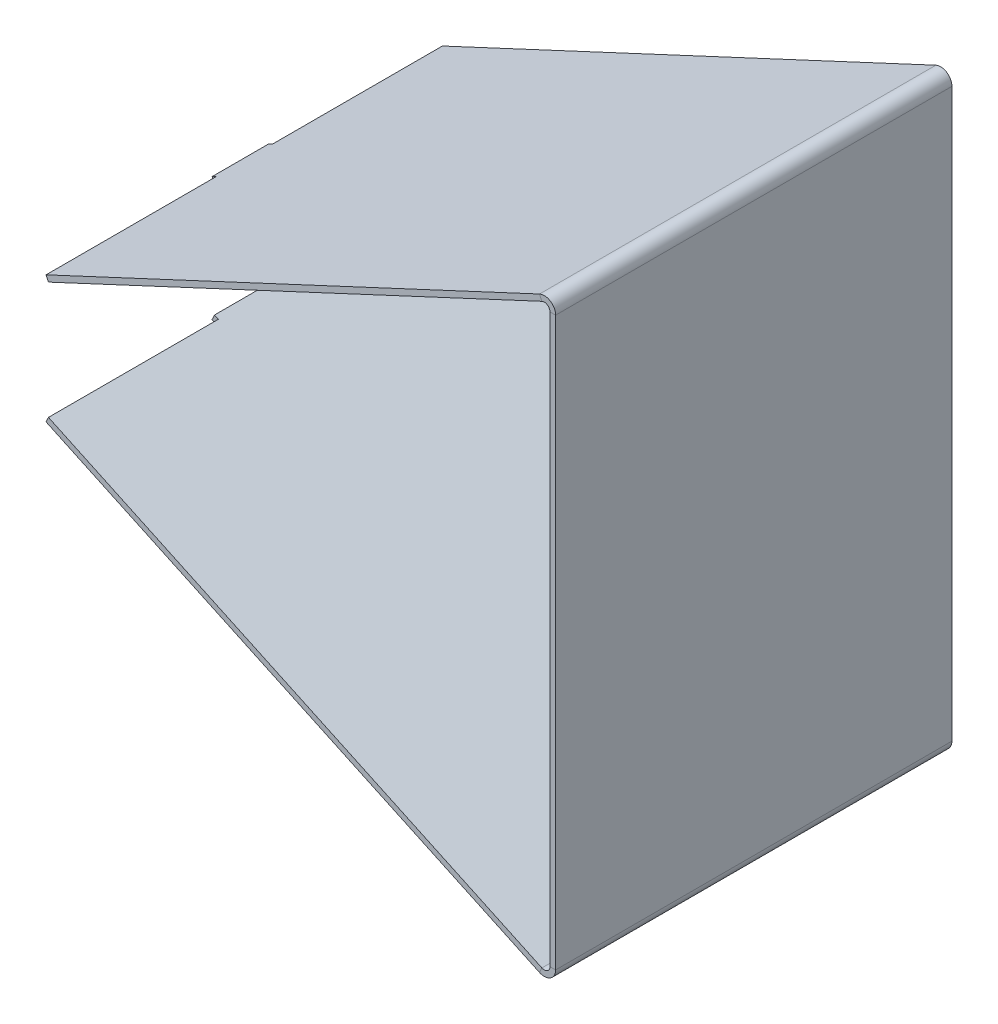
ISO-10303-21;
HEADER;
FILE_DESCRIPTION(('STEP AP214'),'2;1');
FILE_NAME('part.step','',(''),(''),'','','');
FILE_SCHEMA(('AUTOMOTIVE_DESIGN { 1 0 10303 214 1 1 1 1 }'));
ENDSEC;
DATA;
#1=APPLICATION_CONTEXT('core data for automotive mechanical design processes');
#2=APPLICATION_PROTOCOL_DEFINITION('international standard','automotive_design',2000,#1);
#3=PRODUCT_CONTEXT('',#1,'mechanical');
#4=PRODUCT('Part','Part','',(#3));
#5=PRODUCT_RELATED_PRODUCT_CATEGORY('part','',(#4));
#6=PRODUCT_DEFINITION_FORMATION('','',#4);
#7=PRODUCT_DEFINITION_CONTEXT('part definition',#1,'design');
#8=PRODUCT_DEFINITION('design','',#6,#7);
#9=PRODUCT_DEFINITION_SHAPE('','',#8);
#10=(LENGTH_UNIT() NAMED_UNIT(*) SI_UNIT(.MILLI.,.METRE.));
#11=(NAMED_UNIT(*) PLANE_ANGLE_UNIT() SI_UNIT($,.RADIAN.));
#12=(NAMED_UNIT(*) SI_UNIT($,.STERADIAN.) SOLID_ANGLE_UNIT());
#13=UNCERTAINTY_MEASURE_WITH_UNIT(LENGTH_MEASURE(1.E-05),#10,'distance_accuracy_value','');
#14=(GEOMETRIC_REPRESENTATION_CONTEXT(3) GLOBAL_UNCERTAINTY_ASSIGNED_CONTEXT((#13)) GLOBAL_UNIT_ASSIGNED_CONTEXT((#10,
#11,#12)) REPRESENTATION_CONTEXT('',''));
#15=CARTESIAN_POINT('',(0.,0.,0.));
#16=DIRECTION('',(0.,0.,1.));
#17=DIRECTION('',(1.,0.,0.));
#18=AXIS2_PLACEMENT_3D('',#15,#16,#17);
#19=CARTESIAN_POINT('',(640.980552295585,20.6873844259267,142.));
#20=DIRECTION('',(-0.90630778703664,-0.422618261740721,0.));
#21=DIRECTION('',(0.422618261740721,-0.90630778703664,0.));
#22=AXIS2_PLACEMENT_3D('',#19,#20,#21);
#23=PLANE('',#22);
#24=DIRECTION('',(0.,0.,-1.));
#25=VECTOR('',#24,1.);
#26=CARTESIAN_POINT('',(640.980552295585,20.6873844259267,142.));
#27=LINE('',#26,#25);
#28=CARTESIAN_POINT('',(640.980552295585,20.6873844259264,62.));
#29=VERTEX_POINT('',#28);
#30=CARTESIAN_POINT('',(640.980552295585,20.6873844259267,2.));
#31=VERTEX_POINT('',#30);
#32=EDGE_CURVE('E177',#29,#31,#27,.T.);
#33=ORIENTED_EDGE('',*,*,#32,.F.);
#34=DIRECTION('',(-0.422618261740699,0.90630778703665,0.));
#35=VECTOR('',#34,1.);
#36=CARTESIAN_POINT('',(640.980552295585,20.6873844259264,62.));
#37=LINE('',#36,#35);
#38=CARTESIAN_POINT('',(640.135315772103,22.5,62.));
#39=VERTEX_POINT('',#38);
#40=EDGE_CURVE('E184',#29,#39,#37,.T.);
#41=ORIENTED_EDGE('',*,*,#40,.T.);
#42=DIRECTION('',(0.,0.,-1.));
#43=VECTOR('',#42,1.);
#44=CARTESIAN_POINT('',(640.135315772103,22.5,142.));
#45=LINE('',#44,#43);
#46=CARTESIAN_POINT('',(640.135315772103,22.5,2.));
#47=VERTEX_POINT('',#46);
#48=EDGE_CURVE('E198',#39,#47,#45,.T.);
#49=ORIENTED_EDGE('',*,*,#48,.T.);
#50=DIRECTION('',(-0.422618261740721,0.90630778703664,0.));
#51=VECTOR('',#50,1.);
#52=CARTESIAN_POINT('',(640.980552295585,20.6873844259267,2.));
#53=LINE('',#52,#51);
#54=EDGE_CURVE('E193',#31,#47,#53,.T.);
#55=ORIENTED_EDGE('',*,*,#54,.F.);
#56=EDGE_LOOP('',(#33,#41,#49,#55));
#57=FACE_BOUND('',#56,.T.);
#58=ADVANCED_FACE('F36',(#57),#23,.T.);
#59=CARTESIAN_POINT('',(640.135315772103,-22.5,142.));
#60=DIRECTION('',(-0.906307787036642,0.422618261740716,0.));
#61=DIRECTION('',(-0.422618261740716,-0.906307787036642,0.));
#62=AXIS2_PLACEMENT_3D('',#59,#60,#61);
#63=PLANE('',#62);
#64=DIRECTION('',(0.,0.,-1.));
#65=VECTOR('',#64,1.);
#66=CARTESIAN_POINT('',(640.980552295585,-20.6873844259267,142.));
#67=LINE('',#66,#65);
#68=CARTESIAN_POINT('',(640.980552295585,-20.6873844259267,142.));
#69=VERTEX_POINT('',#68);
#70=CARTESIAN_POINT('',(640.980552295585,-20.6873844259264,82.));
#71=VERTEX_POINT('',#70);
#72=EDGE_CURVE('E224',#69,#71,#67,.T.);
#73=ORIENTED_EDGE('',*,*,#72,.T.);
#74=DIRECTION('',(-0.422618261740699,-0.90630778703665,0.));
#75=VECTOR('',#74,1.);
#76=CARTESIAN_POINT('',(640.980552295585,-20.6873844259264,82.));
#77=LINE('',#76,#75);
#78=CARTESIAN_POINT('',(640.135315772103,-22.5,82.));
#79=VERTEX_POINT('',#78);
#80=EDGE_CURVE('E374',#71,#79,#77,.T.);
#81=ORIENTED_EDGE('',*,*,#80,.T.);
#82=DIRECTION('',(0.,0.,-1.));
#83=VECTOR('',#82,1.);
#84=CARTESIAN_POINT('',(640.135315772103,-22.5,142.));
#85=LINE('',#84,#83);
#86=CARTESIAN_POINT('',(640.135315772103,-22.5,142.));
#87=VERTEX_POINT('',#86);
#88=EDGE_CURVE('E220',#87,#79,#85,.T.);
#89=ORIENTED_EDGE('',*,*,#88,.F.);
#90=DIRECTION('',(0.422618261740716,0.906307787036642,0.));
#91=VECTOR('',#90,1.);
#92=CARTESIAN_POINT('',(640.135315772103,-22.5,142.));
#93=LINE('',#92,#91);
#94=EDGE_CURVE('E369',#87,#69,#93,.T.);
#95=ORIENTED_EDGE('',*,*,#94,.T.);
#96=EDGE_LOOP('',(#73,#81,#89,#95));
#97=FACE_BOUND('',#96,.T.);
#98=ADVANCED_FACE('F380',(#97),#63,.T.);
#99=CARTESIAN_POINT('',(820.135315772103,100.15663615943,142.));
#100=DIRECTION('',(0.,0.,1.));
#101=DIRECTION('',(1.,0.,0.));
#102=AXIS2_PLACEMENT_3D('',#99,#100,#101);
#103=PLANE('',#102);
#104=DIRECTION('',(-1.,0.,0.));
#105=VECTOR('',#104,1.);
#106=CARTESIAN_POINT('',(820.135315772103,100.15663615943,142.));
#107=LINE('',#106,#105);
#108=CARTESIAN_POINT('',(820.135315772103,100.15663615943,142.));
#109=VERTEX_POINT('',#108);
#110=CARTESIAN_POINT('',(818.135315772103,100.15663615943,142.));
#111=VERTEX_POINT('',#110);
#112=EDGE_CURVE('E11',#109,#111,#107,.T.);
#113=ORIENTED_EDGE('',*,*,#112,.F.);
#114=CARTESIAN_POINT('',(816.135315772103,100.15663615943,142.));
#115=DIRECTION('',(0.,0.,1.));
#116=DIRECTION('',(1.,0.,0.));
#117=AXIS2_PLACEMENT_3D('',#114,#115,#116);
#118=CIRCLE('',#117,4.);
#119=CARTESIAN_POINT('',(814.44484272514,103.781867307576,142.));
#120=VERTEX_POINT('',#119);
#121=EDGE_CURVE('E257',#120,#109,#118,.F.);
#122=ORIENTED_EDGE('',*,*,#121,.F.);
#123=DIRECTION('',(-0.42261826174072,0.90630778703664,0.));
#124=VECTOR('',#123,1.);
#125=CARTESIAN_POINT('',(815.290079248622,101.969251733503,142.));
#126=LINE('',#125,#124);
#127=CARTESIAN_POINT('',(815.290079248622,101.969251733503,142.));
#128=VERTEX_POINT('',#127);
#129=EDGE_CURVE('E44',#128,#120,#126,.T.);
#130=ORIENTED_EDGE('',*,*,#129,.F.);
#131=CARTESIAN_POINT('',(816.135315772103,100.15663615943,142.));
#132=DIRECTION('',(0.,0.,1.));
#133=DIRECTION('',(1.,0.,0.));
#134=AXIS2_PLACEMENT_3D('',#131,#132,#133);
#135=CIRCLE('',#134,2.);
#136=EDGE_CURVE('E273',#128,#111,#135,.F.);
#137=ORIENTED_EDGE('',*,*,#136,.T.);
#138=EDGE_LOOP('',(#113,#122,#130,#137));
#139=FACE_BOUND('',#138,.T.);
#140=ADVANCED_FACE('F38',(#139),#103,.T.);
#141=CARTESIAN_POINT('',(815.290079248622,101.969251733503,142.));
#142=DIRECTION('',(0.,0.,1.));
#143=DIRECTION('',(1.,0.,0.));
#144=AXIS2_PLACEMENT_3D('',#141,#142,#143);
#145=PLANE('',#144);
#146=DIRECTION('',(0.,-1.,0.));
#147=VECTOR('',#146,1.);
#148=CARTESIAN_POINT('',(820.135315772103,106.4353784679,142.));
#149=LINE('',#148,#147);
#150=CARTESIAN_POINT('',(820.135315772103,-100.15663615943,142.));
#151=VERTEX_POINT('',#150);
#152=EDGE_CURVE('E264',#109,#151,#149,.T.);
#153=ORIENTED_EDGE('',*,*,#152,.F.);
#154=ORIENTED_EDGE('',*,*,#112,.T.);
#155=DIRECTION('',(0.,1.,0.));
#156=VECTOR('',#155,1.);
#157=CARTESIAN_POINT('',(818.135315772103,106.4353784679,142.));
#158=LINE('',#157,#156);
#159=CARTESIAN_POINT('',(818.135315772103,-100.15663615943,142.));
#160=VERTEX_POINT('',#159);
#161=EDGE_CURVE('E275',#111,#160,#158,.F.);
#162=ORIENTED_EDGE('',*,*,#161,.T.);
#163=DIRECTION('',(1.,0.,0.));
#164=VECTOR('',#163,1.);
#165=CARTESIAN_POINT('',(818.135315772103,-100.15663615943,142.));
#166=LINE('',#165,#164);
#167=EDGE_CURVE('E231',#160,#151,#166,.T.);
#168=ORIENTED_EDGE('',*,*,#167,.T.);
#169=EDGE_LOOP('',(#153,#154,#162,#168));
#170=FACE_BOUND('',#169,.T.);
#171=ADVANCED_FACE('F438',(#170),#145,.T.);
#172=CARTESIAN_POINT('',(814.44484272514,103.781867307576,2.));
#173=DIRECTION('',(0.,0.,-1.));
#174=DIRECTION('',(-1.,0.,0.));
#175=AXIS2_PLACEMENT_3D('',#172,#173,#174);
#176=PLANE('',#175);
#177=DIRECTION('',(0.42261826174072,-0.90630778703664,0.));
#178=VECTOR('',#177,1.);
#179=CARTESIAN_POINT('',(814.44484272514,103.781867307576,2.));
#180=LINE('',#179,#178);
#181=CARTESIAN_POINT('',(814.44484272514,103.781867307576,2.));
#182=VERTEX_POINT('',#181);
#183=CARTESIAN_POINT('',(815.290079248622,101.969251733503,2.));
#184=VERTEX_POINT('',#183);
#185=EDGE_CURVE('E237',#182,#184,#180,.T.);
#186=ORIENTED_EDGE('',*,*,#185,.F.);
#187=CARTESIAN_POINT('',(816.135315772103,100.15663615943,2.));
#188=DIRECTION('',(0.,0.,1.));
#189=DIRECTION('',(1.,0.,0.));
#190=AXIS2_PLACEMENT_3D('',#187,#188,#189);
#191=CIRCLE('',#190,4.);
#192=CARTESIAN_POINT('',(820.135315772103,100.15663615943,2.));
#193=VERTEX_POINT('',#192);
#194=EDGE_CURVE('E259',#182,#193,#191,.F.);
#195=ORIENTED_EDGE('',*,*,#194,.T.);
#196=DIRECTION('',(1.,0.,0.));
#197=VECTOR('',#196,1.);
#198=CARTESIAN_POINT('',(818.135315772103,100.15663615943,2.));
#199=LINE('',#198,#197);
#200=CARTESIAN_POINT('',(818.135315772103,100.15663615943,2.));
#201=VERTEX_POINT('',#200);
#202=EDGE_CURVE('E235',#201,#193,#199,.T.);
#203=ORIENTED_EDGE('',*,*,#202,.F.);
#204=CARTESIAN_POINT('',(816.135315772103,100.15663615943,2.));
#205=DIRECTION('',(0.,0.,1.));
#206=DIRECTION('',(1.,0.,0.));
#207=AXIS2_PLACEMENT_3D('',#204,#205,#206);
#208=CIRCLE('',#207,2.);
#209=EDGE_CURVE('E304',#184,#201,#208,.F.);
#210=ORIENTED_EDGE('',*,*,#209,.F.);
#211=EDGE_LOOP('',(#186,#195,#203,#210));
#212=FACE_BOUND('',#211,.T.);
#213=ADVANCED_FACE('F436',(#212),#176,.T.);
#214=CARTESIAN_POINT('',(818.135315772103,100.15663615943,2.));
#215=DIRECTION('',(0.,0.,-1.));
#216=DIRECTION('',(-1.,0.,0.));
#217=AXIS2_PLACEMENT_3D('',#214,#215,#216);
#218=PLANE('',#217);
#219=DIRECTION('',(0.90630778703665,0.4226182617407,0.));
#220=VECTOR('',#219,1.);
#221=CARTESIAN_POINT('',(640.135315772103,22.5,2.));
#222=LINE('',#221,#220);
#223=EDGE_CURVE('E299',#47,#182,#222,.T.);
#224=ORIENTED_EDGE('',*,*,#223,.T.);
#225=ORIENTED_EDGE('',*,*,#185,.T.);
#226=DIRECTION('',(0.90630778703665,0.4226182617407,0.));
#227=VECTOR('',#226,1.);
#228=CARTESIAN_POINT('',(640.980552295585,20.6873844259267,2.));
#229=LINE('',#228,#227);
#230=EDGE_CURVE('E302',#31,#184,#229,.T.);
#231=ORIENTED_EDGE('',*,*,#230,.F.);
#232=ORIENTED_EDGE('',*,*,#54,.T.);
#233=EDGE_LOOP('',(#224,#225,#231,#232));
#234=FACE_BOUND('',#233,.T.);
#235=ADVANCED_FACE('F432',(#234),#218,.T.);
#236=CARTESIAN_POINT('',(814.44484272514,-103.781867307576,142.));
#237=DIRECTION('',(0.,0.,1.));
#238=DIRECTION('',(1.,0.,0.));
#239=AXIS2_PLACEMENT_3D('',#236,#237,#238);
#240=PLANE('',#239);
#241=DIRECTION('',(0.42261826174072,0.90630778703664,0.));
#242=VECTOR('',#241,1.);
#243=CARTESIAN_POINT('',(814.44484272514,-103.781867307576,142.));
#244=LINE('',#243,#242);
#245=CARTESIAN_POINT('',(814.44484272514,-103.781867307576,142.));
#246=VERTEX_POINT('',#245);
#247=CARTESIAN_POINT('',(815.290079248622,-101.969251733503,142.));
#248=VERTEX_POINT('',#247);
#249=EDGE_CURVE('E233',#246,#248,#244,.T.);
#250=ORIENTED_EDGE('',*,*,#249,.F.);
#251=CARTESIAN_POINT('',(816.135315772103,-100.15663615943,142.));
#252=DIRECTION('',(0.,0.,1.));
#253=DIRECTION('',(1.,0.,0.));
#254=AXIS2_PLACEMENT_3D('',#251,#252,#253);
#255=CIRCLE('',#254,4.);
#256=EDGE_CURVE('E345',#151,#246,#255,.F.);
#257=ORIENTED_EDGE('',*,*,#256,.F.);
#258=ORIENTED_EDGE('',*,*,#167,.F.);
#259=CARTESIAN_POINT('',(816.135315772103,-100.15663615943,142.));
#260=DIRECTION('',(0.,0.,1.));
#261=DIRECTION('',(1.,0.,0.));
#262=AXIS2_PLACEMENT_3D('',#259,#260,#261);
#263=CIRCLE('',#262,2.);
#264=EDGE_CURVE('E278',#160,#248,#263,.F.);
#265=ORIENTED_EDGE('',*,*,#264,.T.);
#266=EDGE_LOOP('',(#250,#257,#258,#265));
#267=FACE_BOUND('',#266,.T.);
#268=ADVANCED_FACE('F444',(#267),#240,.T.);
#269=CARTESIAN_POINT('',(818.135315772103,-100.15663615943,142.));
#270=DIRECTION('',(0.,0.,1.));
#271=DIRECTION('',(1.,0.,0.));
#272=AXIS2_PLACEMENT_3D('',#269,#270,#271);
#273=PLANE('',#272);
#274=DIRECTION('',(-0.90630778703665,0.4226182617407,0.));
#275=VECTOR('',#274,1.);
#276=CARTESIAN_POINT('',(820.135315772103,-106.4353784679,142.));
#277=LINE('',#276,#275);
#278=EDGE_CURVE('E371',#246,#87,#277,.T.);
#279=ORIENTED_EDGE('',*,*,#278,.F.);
#280=ORIENTED_EDGE('',*,*,#249,.T.);
#281=DIRECTION('',(-0.90630778703665,0.4226182617407,0.));
#282=VECTOR('',#281,1.);
#283=CARTESIAN_POINT('',(820.980552295584,-104.622762893826,142.));
#284=LINE('',#283,#282);
#285=EDGE_CURVE('E313',#248,#69,#284,.T.);
#286=ORIENTED_EDGE('',*,*,#285,.T.);
#287=ORIENTED_EDGE('',*,*,#94,.F.);
#288=EDGE_LOOP('',(#279,#280,#286,#287));
#289=FACE_BOUND('',#288,.T.);
#290=ADVANCED_FACE('F378',(#289),#273,.T.);
#291=CARTESIAN_POINT('',(820.135315772103,-100.15663615943,2.));
#292=DIRECTION('',(0.,0.,-1.));
#293=DIRECTION('',(-1.,0.,0.));
#294=AXIS2_PLACEMENT_3D('',#291,#292,#293);
#295=PLANE('',#294);
#296=DIRECTION('',(-1.,0.,0.));
#297=VECTOR('',#296,1.);
#298=CARTESIAN_POINT('',(820.135315772103,-100.15663615943,2.));
#299=LINE('',#298,#297);
#300=CARTESIAN_POINT('',(820.135315772103,-100.15663615943,2.));
#301=VERTEX_POINT('',#300);
#302=CARTESIAN_POINT('',(818.135315772103,-100.15663615943,2.));
#303=VERTEX_POINT('',#302);
#304=EDGE_CURVE('E229',#301,#303,#299,.T.);
#305=ORIENTED_EDGE('',*,*,#304,.F.);
#306=CARTESIAN_POINT('',(816.135315772103,-100.15663615943,2.));
#307=DIRECTION('',(0.,0.,1.));
#308=DIRECTION('',(1.,0.,0.));
#309=AXIS2_PLACEMENT_3D('',#306,#307,#308);
#310=CIRCLE('',#309,4.);
#311=CARTESIAN_POINT('',(814.44484272514,-103.781867307576,2.));
#312=VERTEX_POINT('',#311);
#313=EDGE_CURVE('E292',#301,#312,#310,.F.);
#314=ORIENTED_EDGE('',*,*,#313,.T.);
#315=DIRECTION('',(-0.42261826174072,-0.90630778703664,0.));
#316=VECTOR('',#315,1.);
#317=CARTESIAN_POINT('',(815.290079248622,-101.969251733503,2.));
#318=LINE('',#317,#316);
#319=CARTESIAN_POINT('',(815.290079248622,-101.969251733503,2.));
#320=VERTEX_POINT('',#319);
#321=EDGE_CURVE('E227',#320,#312,#318,.T.);
#322=ORIENTED_EDGE('',*,*,#321,.F.);
#323=CARTESIAN_POINT('',(816.135315772103,-100.15663615943,2.));
#324=DIRECTION('',(0.,0.,1.));
#325=DIRECTION('',(1.,0.,0.));
#326=AXIS2_PLACEMENT_3D('',#323,#324,#325);
#327=CIRCLE('',#326,2.);
#328=EDGE_CURVE('E310',#303,#320,#327,.F.);
#329=ORIENTED_EDGE('',*,*,#328,.F.);
#330=EDGE_LOOP('',(#305,#314,#322,#329));
#331=FACE_BOUND('',#330,.T.);
#332=ADVANCED_FACE('F332',(#331),#295,.T.);
#333=CARTESIAN_POINT('',(815.290079248622,-101.969251733503,2.));
#334=DIRECTION('',(0.,0.,-1.));
#335=DIRECTION('',(-1.,0.,0.));
#336=AXIS2_PLACEMENT_3D('',#333,#334,#335);
#337=PLANE('',#336);
#338=DIRECTION('',(0.,-1.,0.));
#339=VECTOR('',#338,1.);
#340=CARTESIAN_POINT('',(820.135315772103,106.4353784679,2.));
#341=LINE('',#340,#339);
#342=EDGE_CURVE('E295',#193,#301,#341,.T.);
#343=ORIENTED_EDGE('',*,*,#342,.T.);
#344=ORIENTED_EDGE('',*,*,#304,.T.);
#345=DIRECTION('',(0.,1.,0.));
#346=VECTOR('',#345,1.);
#347=CARTESIAN_POINT('',(818.135315772103,106.4353784679,2.));
#348=LINE('',#347,#346);
#349=EDGE_CURVE('E307',#201,#303,#348,.F.);
#350=ORIENTED_EDGE('',*,*,#349,.F.);
#351=ORIENTED_EDGE('',*,*,#202,.T.);
#352=EDGE_LOOP('',(#343,#344,#350,#351));
#353=FACE_BOUND('',#352,.T.);
#354=ADVANCED_FACE('F328',(#353),#337,.T.);
#355=CARTESIAN_POINT('',(820.980552295584,-104.622762893826,142.));
#356=DIRECTION('',(-0.4226182617407,-0.90630778703665,0.));
#357=DIRECTION('',(0.90630778703665,-0.4226182617407,0.));
#358=AXIS2_PLACEMENT_3D('',#355,#356,#357);
#359=PLANE('',#358);
#360=DIRECTION('',(-0.90630778703665,0.4226182617407,0.));
#361=VECTOR('',#360,1.);
#362=CARTESIAN_POINT('',(820.980552295584,-104.622762893826,2.));
#363=LINE('',#362,#361);
#364=CARTESIAN_POINT('',(640.980552295585,-20.6873844259267,2.));
#365=VERTEX_POINT('',#364);
#366=EDGE_CURVE('E282',#320,#365,#363,.T.);
#367=ORIENTED_EDGE('',*,*,#366,.T.);
#368=CARTESIAN_POINT('',(640.980552295585,-20.6873844259264,62.));
#369=VERTEX_POINT('',#368);
#370=EDGE_CURVE('E223',#369,#365,#67,.T.);
#371=ORIENTED_EDGE('',*,*,#370,.F.);
#372=DIRECTION('',(0.906307787036644,-0.422618261740713,0.));
#373=VECTOR('',#372,1.);
#374=CARTESIAN_POINT('',(640.980552295585,-20.6873844259264,62.));
#375=LINE('',#374,#373);
#376=CARTESIAN_POINT('',(639.62109061503,-20.0534570333153,62.));
#377=VERTEX_POINT('',#376);
#378=EDGE_CURVE('E383',#377,#369,#375,.T.);
#379=ORIENTED_EDGE('',*,*,#378,.F.);
#380=DIRECTION('',(0.,0.,-1.));
#381=VECTOR('',#380,1.);
#382=CARTESIAN_POINT('',(639.62109061503,-20.0534570333153,62.));
#383=LINE('',#382,#381);
#384=CARTESIAN_POINT('',(639.62109061503,-20.0534570333153,82.));
#385=VERTEX_POINT('',#384);
#386=EDGE_CURVE('E385',#385,#377,#383,.T.);
#387=ORIENTED_EDGE('',*,*,#386,.F.);
#388=DIRECTION('',(-0.906307787036644,0.422618261740713,0.));
#389=VECTOR('',#388,1.);
#390=CARTESIAN_POINT('',(640.980552295585,-20.6873844259264,82.));
#391=LINE('',#390,#389);
#392=EDGE_CURVE('E391',#71,#385,#391,.T.);
#393=ORIENTED_EDGE('',*,*,#392,.F.);
#394=ORIENTED_EDGE('',*,*,#72,.F.);
#395=ORIENTED_EDGE('',*,*,#285,.F.);
#396=DIRECTION('',(0.,0.,-1.));
#397=VECTOR('',#396,1.);
#398=CARTESIAN_POINT('',(815.290079248622,-101.969251733503,142.));
#399=LINE('',#398,#397);
#400=EDGE_CURVE('E281',#248,#320,#399,.T.);
#401=ORIENTED_EDGE('',*,*,#400,.T.);
#402=EDGE_LOOP('',(#367,#371,#379,#387,#393,#394,#395,#401));
#403=FACE_BOUND('',#402,.T.);
#404=ADVANCED_FACE('F362',(#403),#359,.F.);
#405=DIRECTION('',(-0.422618261740699,-0.90630778703665,0.));
#406=VECTOR('',#405,1.);
#407=CARTESIAN_POINT('',(640.980552295585,-20.6873844259264,62.));
#408=LINE('',#407,#406);
#409=CARTESIAN_POINT('',(640.135315772103,-22.4999999999997,62.));
#410=VERTEX_POINT('',#409);
#411=EDGE_CURVE('E286',#369,#410,#408,.T.);
#412=ORIENTED_EDGE('',*,*,#411,.F.);
#413=ORIENTED_EDGE('',*,*,#370,.T.);
#414=DIRECTION('',(0.422618261740716,0.906307787036642,0.));
#415=VECTOR('',#414,1.);
#416=CARTESIAN_POINT('',(640.135315772103,-22.5,2.));
#417=LINE('',#416,#415);
#418=CARTESIAN_POINT('',(640.135315772103,-22.5,2.));
#419=VERTEX_POINT('',#418);
#420=EDGE_CURVE('E285',#419,#365,#417,.T.);
#421=ORIENTED_EDGE('',*,*,#420,.F.);
#422=EDGE_CURVE('E219',#410,#419,#85,.T.);
#423=ORIENTED_EDGE('',*,*,#422,.F.);
#424=EDGE_LOOP('',(#412,#413,#421,#423));
#425=FACE_BOUND('',#424,.T.);
#426=ADVANCED_FACE('F410',(#425),#63,.T.);
#427=CARTESIAN_POINT('',(820.135315772103,-106.4353784679,142.));
#428=DIRECTION('',(-0.4226182617407,-0.90630778703665,0.));
#429=DIRECTION('',(0.90630778703665,-0.4226182617407,0.));
#430=AXIS2_PLACEMENT_3D('',#427,#428,#429);
#431=PLANE('',#430);
#432=DIRECTION('',(-0.90630778703665,0.4226182617407,0.));
#433=VECTOR('',#432,1.);
#434=CARTESIAN_POINT('',(820.135315772103,-106.4353784679,2.));
#435=LINE('',#434,#433);
#436=EDGE_CURVE('E289',#312,#419,#435,.T.);
#437=ORIENTED_EDGE('',*,*,#436,.F.);
#438=DIRECTION('',(0.,0.,-1.));
#439=VECTOR('',#438,1.);
#440=CARTESIAN_POINT('',(814.44484272514,-103.781867307576,142.));
#441=LINE('',#440,#439);
#442=EDGE_CURVE('E216',#246,#312,#441,.T.);
#443=ORIENTED_EDGE('',*,*,#442,.F.);
#444=ORIENTED_EDGE('',*,*,#278,.T.);
#445=ORIENTED_EDGE('',*,*,#88,.T.);
#446=DIRECTION('',(-0.906307787036644,0.422618261740713,0.));
#447=VECTOR('',#446,1.);
#448=CARTESIAN_POINT('',(640.135315772103,-22.4999999999997,82.));
#449=LINE('',#448,#447);
#450=CARTESIAN_POINT('',(638.775854091548,-21.8660726073886,82.));
#451=VERTEX_POINT('',#450);
#452=EDGE_CURVE('E59',#79,#451,#449,.T.);
#453=ORIENTED_EDGE('',*,*,#452,.T.);
#454=DIRECTION('',(0.,0.,-1.));
#455=VECTOR('',#454,1.);
#456=CARTESIAN_POINT('',(638.775854091548,-21.8660726073886,62.));
#457=LINE('',#456,#455);
#458=CARTESIAN_POINT('',(638.775854091548,-21.8660726073886,62.));
#459=VERTEX_POINT('',#458);
#460=EDGE_CURVE('E396',#451,#459,#457,.T.);
#461=ORIENTED_EDGE('',*,*,#460,.T.);
#462=DIRECTION('',(0.906307787036644,-0.422618261740713,0.));
#463=VECTOR('',#462,1.);
#464=CARTESIAN_POINT('',(640.135315772103,-22.4999999999997,62.));
#465=LINE('',#464,#463);
#466=EDGE_CURVE('E400',#459,#410,#465,.T.);
#467=ORIENTED_EDGE('',*,*,#466,.T.);
#468=ORIENTED_EDGE('',*,*,#422,.T.);
#469=EDGE_LOOP('',(#437,#443,#444,#445,#453,#461,#467,#468));
#470=FACE_BOUND('',#469,.T.);
#471=ADVANCED_FACE('F349',(#470),#431,.T.);
#472=CARTESIAN_POINT('',(816.135315772103,-100.15663615943,142.));
#473=DIRECTION('',(0.,0.,-1.));
#474=DIRECTION('',(-1.,0.,0.));
#475=AXIS2_PLACEMENT_3D('',#472,#473,#474);
#476=CYLINDRICAL_SURFACE('',#475,4.);
#477=ORIENTED_EDGE('',*,*,#313,.F.);
#478=DIRECTION('',(0.,0.,-1.));
#479=VECTOR('',#478,1.);
#480=CARTESIAN_POINT('',(820.135315772103,-100.15663615943,142.));
#481=LINE('',#480,#479);
#482=EDGE_CURVE('E213',#151,#301,#481,.T.);
#483=ORIENTED_EDGE('',*,*,#482,.F.);
#484=ORIENTED_EDGE('',*,*,#256,.T.);
#485=ORIENTED_EDGE('',*,*,#442,.T.);
#486=EDGE_LOOP('',(#477,#483,#484,#485));
#487=FACE_BOUND('',#486,.T.);
#488=ADVANCED_FACE('F342',(#487),#476,.T.);
#489=CARTESIAN_POINT('',(820.135315772103,106.4353784679,142.));
#490=DIRECTION('',(1.,0.,0.));
#491=DIRECTION('',(0.,0.,-1.));
#492=AXIS2_PLACEMENT_3D('',#489,#490,#491);
#493=PLANE('',#492);
#494=ORIENTED_EDGE('',*,*,#342,.F.);
#495=DIRECTION('',(0.,0.,-1.));
#496=VECTOR('',#495,1.);
#497=CARTESIAN_POINT('',(820.135315772103,100.15663615943,142.));
#498=LINE('',#497,#496);
#499=EDGE_CURVE('E210',#109,#193,#498,.T.);
#500=ORIENTED_EDGE('',*,*,#499,.F.);
#501=ORIENTED_EDGE('',*,*,#152,.T.);
#502=ORIENTED_EDGE('',*,*,#482,.T.);
#503=EDGE_LOOP('',(#494,#500,#501,#502));
#504=FACE_BOUND('',#503,.T.);
#505=ADVANCED_FACE('F337',(#504),#493,.T.);
#506=CARTESIAN_POINT('',(816.135315772103,100.15663615943,142.));
#507=DIRECTION('',(0.,0.,-1.));
#508=DIRECTION('',(-1.,0.,0.));
#509=AXIS2_PLACEMENT_3D('',#506,#507,#508);
#510=CYLINDRICAL_SURFACE('',#509,4.);
#511=ORIENTED_EDGE('',*,*,#194,.F.);
#512=DIRECTION('',(0.,0.,-1.));
#513=VECTOR('',#512,1.);
#514=CARTESIAN_POINT('',(814.44484272514,103.781867307576,142.));
#515=LINE('',#514,#513);
#516=EDGE_CURVE('E207',#120,#182,#515,.T.);
#517=ORIENTED_EDGE('',*,*,#516,.F.);
#518=ORIENTED_EDGE('',*,*,#121,.T.);
#519=ORIENTED_EDGE('',*,*,#499,.T.);
#520=EDGE_LOOP('',(#511,#517,#518,#519));
#521=FACE_BOUND('',#520,.T.);
#522=ADVANCED_FACE('F256',(#521),#510,.T.);
#523=CARTESIAN_POINT('',(640.135315772103,22.5,142.));
#524=DIRECTION('',(-0.4226182617407,0.90630778703665,0.));
#525=DIRECTION('',(-0.90630778703665,-0.4226182617407,0.));
#526=AXIS2_PLACEMENT_3D('',#523,#524,#525);
#527=PLANE('',#526);
#528=ORIENTED_EDGE('',*,*,#223,.F.);
#529=ORIENTED_EDGE('',*,*,#48,.F.);
#530=DIRECTION('',(0.906307787036644,0.422618261740713,0.));
#531=VECTOR('',#530,1.);
#532=CARTESIAN_POINT('',(640.135315772103,22.4999999999997,62.));
#533=LINE('',#532,#531);
#534=CARTESIAN_POINT('',(638.775854091548,21.8660726073886,62.));
#535=VERTEX_POINT('',#534);
#536=EDGE_CURVE('E51',#535,#39,#533,.T.);
#537=ORIENTED_EDGE('',*,*,#536,.F.);
#538=DIRECTION('',(0.,0.,-1.));
#539=VECTOR('',#538,1.);
#540=CARTESIAN_POINT('',(638.775854091548,21.8660726073886,62.));
#541=LINE('',#540,#539);
#542=CARTESIAN_POINT('',(638.775854091548,21.8660726073886,82.));
#543=VERTEX_POINT('',#542);
#544=EDGE_CURVE('E420',#543,#535,#541,.T.);
#545=ORIENTED_EDGE('',*,*,#544,.F.);
#546=DIRECTION('',(-0.906307787036644,-0.422618261740713,0.));
#547=VECTOR('',#546,1.);
#548=CARTESIAN_POINT('',(640.135315772103,22.4999999999997,82.));
#549=LINE('',#548,#547);
#550=CARTESIAN_POINT('',(640.135315772103,22.4999999999997,82.));
#551=VERTEX_POINT('',#550);
#552=EDGE_CURVE('E182',#551,#543,#549,.T.);
#553=ORIENTED_EDGE('',*,*,#552,.F.);
#554=CARTESIAN_POINT('',(640.135315772103,22.5,142.));
#555=VERTEX_POINT('',#554);
#556=EDGE_CURVE('E204',#555,#551,#45,.T.);
#557=ORIENTED_EDGE('',*,*,#556,.F.);
#558=DIRECTION('',(0.90630778703665,0.4226182617407,0.));
#559=VECTOR('',#558,1.);
#560=CARTESIAN_POINT('',(640.135315772103,22.5,142.));
#561=LINE('',#560,#559);
#562=EDGE_CURVE('E245',#555,#120,#561,.T.);
#563=ORIENTED_EDGE('',*,*,#562,.T.);
#564=ORIENTED_EDGE('',*,*,#516,.T.);
#565=EDGE_LOOP('',(#528,#529,#537,#545,#553,#557,#563,#564));
#566=FACE_BOUND('',#565,.T.);
#567=ADVANCED_FACE('F266',(#566),#527,.T.);
#568=DIRECTION('',(-0.422618261740699,0.90630778703665,0.));
#569=VECTOR('',#568,1.);
#570=CARTESIAN_POINT('',(640.980552295585,20.6873844259264,82.));
#571=LINE('',#570,#569);
#572=CARTESIAN_POINT('',(640.980552295585,20.6873844259264,82.));
#573=VERTEX_POINT('',#572);
#574=EDGE_CURVE('E397',#573,#551,#571,.T.);
#575=ORIENTED_EDGE('',*,*,#574,.F.);
#576=CARTESIAN_POINT('',(640.980552295585,20.6873844259267,142.));
#577=VERTEX_POINT('',#576);
#578=EDGE_CURVE('E194',#577,#573,#27,.T.);
#579=ORIENTED_EDGE('',*,*,#578,.F.);
#580=DIRECTION('',(-0.422618261740721,0.90630778703664,0.));
#581=VECTOR('',#580,1.);
#582=CARTESIAN_POINT('',(640.980552295585,20.6873844259267,142.));
#583=LINE('',#582,#581);
#584=EDGE_CURVE('E267',#577,#555,#583,.T.);
#585=ORIENTED_EDGE('',*,*,#584,.T.);
#586=ORIENTED_EDGE('',*,*,#556,.T.);
#587=EDGE_LOOP('',(#575,#579,#585,#586));
#588=FACE_BOUND('',#587,.T.);
#589=ADVANCED_FACE('F449',(#588),#23,.T.);
#590=CARTESIAN_POINT('',(640.980552295585,20.6873844259267,142.));
#591=DIRECTION('',(-0.4226182617407,0.90630778703665,0.));
#592=DIRECTION('',(-0.90630778703665,-0.4226182617407,0.));
#593=AXIS2_PLACEMENT_3D('',#590,#591,#592);
#594=PLANE('',#593);
#595=ORIENTED_EDGE('',*,*,#230,.T.);
#596=DIRECTION('',(0.,0.,-1.));
#597=VECTOR('',#596,1.);
#598=CARTESIAN_POINT('',(815.290079248622,101.969251733503,142.));
#599=LINE('',#598,#597);
#600=EDGE_CURVE('E195',#128,#184,#599,.T.);
#601=ORIENTED_EDGE('',*,*,#600,.F.);
#602=DIRECTION('',(0.90630778703665,0.4226182617407,0.));
#603=VECTOR('',#602,1.);
#604=CARTESIAN_POINT('',(640.980552295585,20.6873844259267,142.));
#605=LINE('',#604,#603);
#606=EDGE_CURVE('E248',#577,#128,#605,.T.);
#607=ORIENTED_EDGE('',*,*,#606,.F.);
#608=ORIENTED_EDGE('',*,*,#578,.T.);
#609=DIRECTION('',(-0.906307787036644,-0.422618261740713,0.));
#610=VECTOR('',#609,1.);
#611=CARTESIAN_POINT('',(640.980552295585,20.6873844259264,82.));
#612=LINE('',#611,#610);
#613=CARTESIAN_POINT('',(639.62109061503,20.0534570333153,82.));
#614=VERTEX_POINT('',#613);
#615=EDGE_CURVE('E189',#573,#614,#612,.T.);
#616=ORIENTED_EDGE('',*,*,#615,.T.);
#617=DIRECTION('',(0.,0.,-1.));
#618=VECTOR('',#617,1.);
#619=CARTESIAN_POINT('',(639.62109061503,20.0534570333153,62.));
#620=LINE('',#619,#618);
#621=CARTESIAN_POINT('',(639.62109061503,20.0534570333153,62.));
#622=VERTEX_POINT('',#621);
#623=EDGE_CURVE('E180',#614,#622,#620,.T.);
#624=ORIENTED_EDGE('',*,*,#623,.T.);
#625=DIRECTION('',(0.906307787036644,0.422618261740713,0.));
#626=VECTOR('',#625,1.);
#627=CARTESIAN_POINT('',(640.980552295585,20.6873844259264,62.));
#628=LINE('',#627,#626);
#629=EDGE_CURVE('E173',#622,#29,#628,.T.);
#630=ORIENTED_EDGE('',*,*,#629,.T.);
#631=ORIENTED_EDGE('',*,*,#32,.T.);
#632=EDGE_LOOP('',(#595,#601,#607,#608,#616,#624,#630,#631));
#633=FACE_BOUND('',#632,.T.);
#634=ADVANCED_FACE('F175',(#633),#594,.F.);
#635=CARTESIAN_POINT('',(816.135315772103,100.15663615943,142.));
#636=DIRECTION('',(0.,0.,-1.));
#637=DIRECTION('',(-1.,0.,0.));
#638=AXIS2_PLACEMENT_3D('',#635,#636,#637);
#639=CYLINDRICAL_SURFACE('',#638,2.);
#640=ORIENTED_EDGE('',*,*,#209,.T.);
#641=DIRECTION('',(0.,0.,-1.));
#642=VECTOR('',#641,1.);
#643=CARTESIAN_POINT('',(818.135315772103,100.15663615943,142.));
#644=LINE('',#643,#642);
#645=EDGE_CURVE('E200',#111,#201,#644,.T.);
#646=ORIENTED_EDGE('',*,*,#645,.F.);
#647=ORIENTED_EDGE('',*,*,#136,.F.);
#648=ORIENTED_EDGE('',*,*,#600,.T.);
#649=EDGE_LOOP('',(#640,#646,#647,#648));
#650=FACE_BOUND('',#649,.T.);
#651=ADVANCED_FACE('F434',(#650),#639,.F.);
#652=CARTESIAN_POINT('',(818.135315772103,106.4353784679,142.));
#653=DIRECTION('',(1.,0.,0.));
#654=DIRECTION('',(0.,0.,-1.));
#655=AXIS2_PLACEMENT_3D('',#652,#653,#654);
#656=PLANE('',#655);
#657=ORIENTED_EDGE('',*,*,#349,.T.);
#658=DIRECTION('',(0.,0.,-1.));
#659=VECTOR('',#658,1.);
#660=CARTESIAN_POINT('',(818.135315772103,-100.15663615943,142.));
#661=LINE('',#660,#659);
#662=EDGE_CURVE('E316',#160,#303,#661,.T.);
#663=ORIENTED_EDGE('',*,*,#662,.F.);
#664=ORIENTED_EDGE('',*,*,#161,.F.);
#665=ORIENTED_EDGE('',*,*,#645,.T.);
#666=EDGE_LOOP('',(#657,#663,#664,#665));
#667=FACE_BOUND('',#666,.T.);
#668=ADVANCED_FACE('F323',(#667),#656,.F.);
#669=CARTESIAN_POINT('',(816.135315772103,-100.15663615943,142.));
#670=DIRECTION('',(0.,0.,-1.));
#671=DIRECTION('',(-1.,0.,0.));
#672=AXIS2_PLACEMENT_3D('',#669,#670,#671);
#673=CYLINDRICAL_SURFACE('',#672,2.);
#674=ORIENTED_EDGE('',*,*,#328,.T.);
#675=ORIENTED_EDGE('',*,*,#400,.F.);
#676=ORIENTED_EDGE('',*,*,#264,.F.);
#677=ORIENTED_EDGE('',*,*,#662,.T.);
#678=EDGE_LOOP('',(#674,#675,#676,#677));
#679=FACE_BOUND('',#678,.T.);
#680=ADVANCED_FACE('F358',(#679),#673,.F.);
#681=CARTESIAN_POINT('',(816.135315772103,-100.15663615943,142.));
#682=DIRECTION('',(0.,0.,1.));
#683=DIRECTION('',(1.,0.,0.));
#684=AXIS2_PLACEMENT_3D('',#681,#682,#683);
#685=PLANE('',#684);
#686=ORIENTED_EDGE('',*,*,#606,.T.);
#687=ORIENTED_EDGE('',*,*,#129,.T.);
#688=ORIENTED_EDGE('',*,*,#562,.F.);
#689=ORIENTED_EDGE('',*,*,#584,.F.);
#690=EDGE_LOOP('',(#686,#687,#688,#689));
#691=FACE_BOUND('',#690,.T.);
#692=ADVANCED_FACE('F242',(#691),#685,.T.);
#693=CARTESIAN_POINT('',(816.135315772103,-100.15663615943,2.));
#694=DIRECTION('',(0.,0.,1.));
#695=DIRECTION('',(1.,0.,0.));
#696=AXIS2_PLACEMENT_3D('',#693,#694,#695);
#697=PLANE('',#696);
#698=ORIENTED_EDGE('',*,*,#366,.F.);
#699=ORIENTED_EDGE('',*,*,#321,.T.);
#700=ORIENTED_EDGE('',*,*,#436,.T.);
#701=ORIENTED_EDGE('',*,*,#420,.T.);
#702=EDGE_LOOP('',(#698,#699,#700,#701));
#703=FACE_BOUND('',#702,.T.);
#704=ADVANCED_FACE('F355',(#703),#697,.F.);
#705=CARTESIAN_POINT('',(640.980552295585,-20.6873844259264,62.));
#706=DIRECTION('',(0.,0.,-1.));
#707=DIRECTION('',(-1.,0.,0.));
#708=AXIS2_PLACEMENT_3D('',#705,#706,#707);
#709=PLANE('',#708);
#710=ORIENTED_EDGE('',*,*,#466,.F.);
#711=DIRECTION('',(-0.422618261740699,-0.90630778703665,0.));
#712=VECTOR('',#711,1.);
#713=CARTESIAN_POINT('',(639.62109061503,-20.0534570333153,62.));
#714=LINE('',#713,#712);
#715=EDGE_CURVE('E384',#377,#459,#714,.T.);
#716=ORIENTED_EDGE('',*,*,#715,.F.);
#717=ORIENTED_EDGE('',*,*,#378,.T.);
#718=ORIENTED_EDGE('',*,*,#411,.T.);
#719=EDGE_LOOP('',(#710,#716,#717,#718));
#720=FACE_BOUND('',#719,.T.);
#721=ADVANCED_FACE('F408',(#720),#709,.T.);
#722=CARTESIAN_POINT('',(639.62109061503,-20.0534570333153,62.));
#723=DIRECTION('',(-0.90630778703665,0.422618261740699,0.));
#724=DIRECTION('',(-0.422618261740699,-0.90630778703665,0.));
#725=AXIS2_PLACEMENT_3D('',#722,#723,#724);
#726=PLANE('',#725);
#727=ORIENTED_EDGE('',*,*,#460,.F.);
#728=DIRECTION('',(-0.422618261740699,-0.90630778703665,0.));
#729=VECTOR('',#728,1.);
#730=CARTESIAN_POINT('',(639.62109061503,-20.0534570333153,82.));
#731=LINE('',#730,#729);
#732=EDGE_CURVE('E382',#385,#451,#731,.T.);
#733=ORIENTED_EDGE('',*,*,#732,.F.);
#734=ORIENTED_EDGE('',*,*,#386,.T.);
#735=ORIENTED_EDGE('',*,*,#715,.T.);
#736=EDGE_LOOP('',(#727,#733,#734,#735));
#737=FACE_BOUND('',#736,.T.);
#738=ADVANCED_FACE('F405',(#737),#726,.T.);
#739=CARTESIAN_POINT('',(640.980552295585,-20.6873844259264,82.));
#740=DIRECTION('',(0.,0.,1.));
#741=DIRECTION('',(1.,0.,0.));
#742=AXIS2_PLACEMENT_3D('',#739,#740,#741);
#743=PLANE('',#742);
#744=ORIENTED_EDGE('',*,*,#452,.F.);
#745=ORIENTED_EDGE('',*,*,#80,.F.);
#746=ORIENTED_EDGE('',*,*,#392,.T.);
#747=ORIENTED_EDGE('',*,*,#732,.T.);
#748=EDGE_LOOP('',(#744,#745,#746,#747));
#749=FACE_BOUND('',#748,.T.);
#750=ADVANCED_FACE('F411',(#749),#743,.T.);
#751=CARTESIAN_POINT('',(640.980552295585,20.6873844259264,82.));
#752=DIRECTION('',(0.,0.,-1.));
#753=DIRECTION('',(-1.,0.,0.));
#754=AXIS2_PLACEMENT_3D('',#751,#752,#753);
#755=PLANE('',#754);
#756=ORIENTED_EDGE('',*,*,#552,.T.);
#757=DIRECTION('',(-0.422618261740699,0.90630778703665,0.));
#758=VECTOR('',#757,1.);
#759=CARTESIAN_POINT('',(639.62109061503,20.0534570333153,82.));
#760=LINE('',#759,#758);
#761=EDGE_CURVE('E414',#614,#543,#760,.T.);
#762=ORIENTED_EDGE('',*,*,#761,.F.);
#763=ORIENTED_EDGE('',*,*,#615,.F.);
#764=ORIENTED_EDGE('',*,*,#574,.T.);
#765=EDGE_LOOP('',(#756,#762,#763,#764));
#766=FACE_BOUND('',#765,.T.);
#767=ADVANCED_FACE('F427',(#766),#755,.F.);
#768=CARTESIAN_POINT('',(639.62109061503,20.0534570333153,62.));
#769=DIRECTION('',(0.90630778703665,0.422618261740699,0.));
#770=DIRECTION('',(-0.422618261740699,0.90630778703665,0.));
#771=AXIS2_PLACEMENT_3D('',#768,#769,#770);
#772=PLANE('',#771);
#773=ORIENTED_EDGE('',*,*,#544,.T.);
#774=DIRECTION('',(-0.422618261740699,0.90630778703665,0.));
#775=VECTOR('',#774,1.);
#776=CARTESIAN_POINT('',(639.62109061503,20.0534570333153,62.));
#777=LINE('',#776,#775);
#778=EDGE_CURVE('E188',#622,#535,#777,.T.);
#779=ORIENTED_EDGE('',*,*,#778,.F.);
#780=ORIENTED_EDGE('',*,*,#623,.F.);
#781=ORIENTED_EDGE('',*,*,#761,.T.);
#782=EDGE_LOOP('',(#773,#779,#780,#781));
#783=FACE_BOUND('',#782,.T.);
#784=ADVANCED_FACE('F430',(#783),#772,.F.);
#785=CARTESIAN_POINT('',(640.980552295585,20.6873844259264,62.));
#786=DIRECTION('',(0.,0.,1.));
#787=DIRECTION('',(1.,0.,0.));
#788=AXIS2_PLACEMENT_3D('',#785,#786,#787);
#789=PLANE('',#788);
#790=ORIENTED_EDGE('',*,*,#536,.T.);
#791=ORIENTED_EDGE('',*,*,#40,.F.);
#792=ORIENTED_EDGE('',*,*,#629,.F.);
#793=ORIENTED_EDGE('',*,*,#778,.T.);
#794=EDGE_LOOP('',(#790,#791,#792,#793));
#795=FACE_BOUND('',#794,.T.);
#796=ADVANCED_FACE('F185',(#795),#789,.F.);
#797=CLOSED_SHELL('',(#58,#98,#140,#171,#213,#235,#268,#290,#332,#354,#404,#426,#471,#488,#505,
#522,#567,#589,#634,#651,#668,#680,#692,#704,#721,#738,#750,#767,#784,#796));
#798=MANIFOLD_SOLID_BREP('B2',#797);
#799=ADVANCED_BREP_SHAPE_REPRESENTATION('',(#18,#798),#14);
#800=SHAPE_DEFINITION_REPRESENTATION(#9,#799);
ENDSEC;
END-ISO-10303-21;
